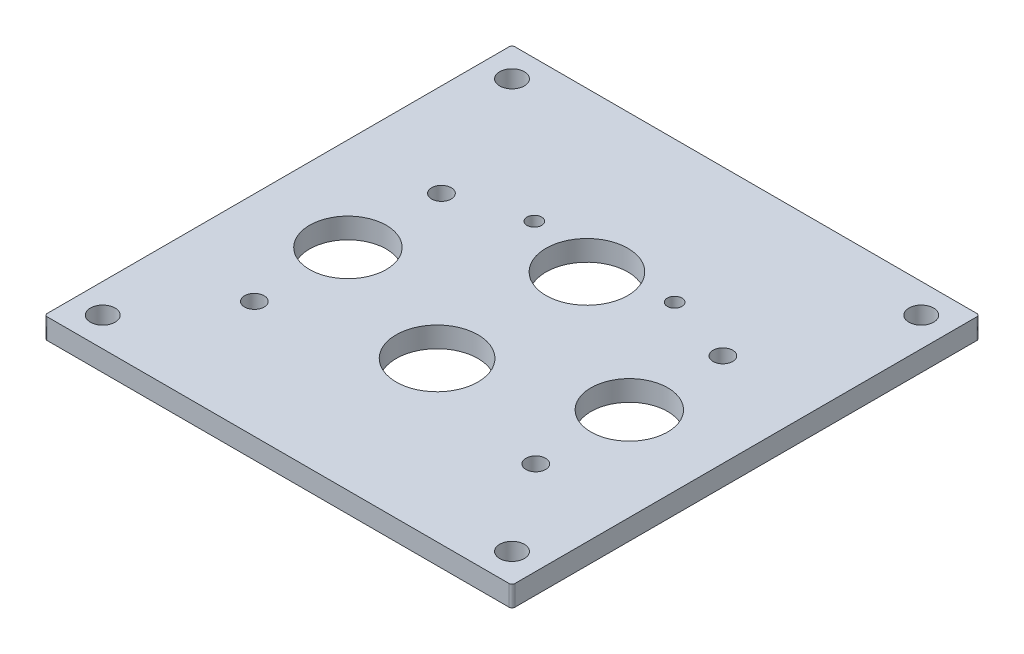
ISO-10303-21;
HEADER;
FILE_DESCRIPTION(('STEP AP214'),'2;1');
FILE_NAME('part.step','',(''),(''),'','','');
FILE_SCHEMA(('AUTOMOTIVE_DESIGN { 1 0 10303 214 1 1 1 1 }'));
ENDSEC;
DATA;
#1=APPLICATION_CONTEXT('core data for automotive mechanical design processes');
#2=APPLICATION_PROTOCOL_DEFINITION('international standard','automotive_design',2000,#1);
#3=PRODUCT_CONTEXT('',#1,'mechanical');
#4=PRODUCT('Part','Part','',(#3));
#5=PRODUCT_RELATED_PRODUCT_CATEGORY('part','',(#4));
#6=PRODUCT_DEFINITION_FORMATION('','',#4);
#7=PRODUCT_DEFINITION_CONTEXT('part definition',#1,'design');
#8=PRODUCT_DEFINITION('design','',#6,#7);
#9=PRODUCT_DEFINITION_SHAPE('','',#8);
#10=(LENGTH_UNIT() NAMED_UNIT(*) SI_UNIT(.MILLI.,.METRE.));
#11=(NAMED_UNIT(*) PLANE_ANGLE_UNIT() SI_UNIT($,.RADIAN.));
#12=(NAMED_UNIT(*) SI_UNIT($,.STERADIAN.) SOLID_ANGLE_UNIT());
#13=UNCERTAINTY_MEASURE_WITH_UNIT(LENGTH_MEASURE(1.E-05),#10,'distance_accuracy_value','');
#14=(GEOMETRIC_REPRESENTATION_CONTEXT(3) GLOBAL_UNCERTAINTY_ASSIGNED_CONTEXT((#13)) GLOBAL_UNIT_ASSIGNED_CONTEXT((#10,
#11,#12)) REPRESENTATION_CONTEXT('',''));
#15=CARTESIAN_POINT('',(0.,0.,0.));
#16=DIRECTION('',(0.,0.,1.));
#17=DIRECTION('',(1.,0.,0.));
#18=AXIS2_PLACEMENT_3D('',#15,#16,#17);
#19=CARTESIAN_POINT('',(76.3793482316,0.,47.8960233086));
#20=DIRECTION('',(0.,-1.,0.));
#21=DIRECTION('',(0.,0.,-1.));
#22=AXIS2_PLACEMENT_3D('',#19,#20,#21);
#23=CYLINDRICAL_SURFACE('',#22,0.79375000000001);
#24=DIRECTION('',(0.,1.,0.));
#25=VECTOR('',#24,1.);
#26=CARTESIAN_POINT('',(77.1730982344487,0.,47.8960233086));
#27=LINE('',#26,#25);
#28=CARTESIAN_POINT('',(77.1730982330243,-5.588,47.8960233086));
#29=VERTEX_POINT('',#28);
#30=CARTESIAN_POINT('',(77.1730982330243,0.,47.8960233086));
#31=VERTEX_POINT('',#30);
#32=EDGE_CURVE('E101',#29,#31,#27,.T.);
#33=ORIENTED_EDGE('',*,*,#32,.T.);
#34=CARTESIAN_POINT('',(76.3793482316,0.,47.8960233086));
#35=DIRECTION('',(0.,-1.,0.));
#36=DIRECTION('',(0.,0.,-1.));
#37=AXIS2_PLACEMENT_3D('',#34,#35,#36);
#38=CIRCLE('',#37,0.79375000000001);
#39=CARTESIAN_POINT('',(76.3793482316,0.,48.6897733032364));
#40=VERTEX_POINT('',#39);
#41=EDGE_CURVE('E20',#40,#31,#38,.F.);
#42=ORIENTED_EDGE('',*,*,#41,.F.);
#43=DIRECTION('',(0.,1.,0.));
#44=VECTOR('',#43,1.);
#45=CARTESIAN_POINT('',(76.3793482316,0.,48.6897732978727));
#46=LINE('',#45,#44);
#47=CARTESIAN_POINT('',(76.3793482316,-5.588,48.6897733032364));
#48=VERTEX_POINT('',#47);
#49=EDGE_CURVE('E112',#40,#48,#46,.F.);
#50=ORIENTED_EDGE('',*,*,#49,.T.);
#51=CARTESIAN_POINT('',(76.3793482316,-5.588,47.8960233086));
#52=DIRECTION('',(0.,-1.,0.));
#53=DIRECTION('',(0.,0.,-1.));
#54=AXIS2_PLACEMENT_3D('',#51,#52,#53);
#55=CIRCLE('',#54,0.79375000000001);
#56=EDGE_CURVE('E225',#29,#48,#55,.T.);
#57=ORIENTED_EDGE('',*,*,#56,.F.);
#58=EDGE_LOOP('',(#33,#42,#50,#57));
#59=FACE_BOUND('',#58,.T.);
#60=ADVANCED_FACE('F17',(#59),#23,.T.);
#61=CARTESIAN_POINT('',(-49.0331517684,0.,47.8960233086));
#62=DIRECTION('',(0.,-1.,0.));
#63=DIRECTION('',(0.,0.,-1.));
#64=AXIS2_PLACEMENT_3D('',#61,#62,#63);
#65=CYLINDRICAL_SURFACE('',#64,0.793749999999996);
#66=DIRECTION('',(0.,1.,0.));
#67=VECTOR('',#66,1.);
#68=CARTESIAN_POINT('',(-49.0331517684,0.,48.6897732978727));
#69=LINE('',#68,#67);
#70=CARTESIAN_POINT('',(-49.0331517684,-5.588,48.6897733032364));
#71=VERTEX_POINT('',#70);
#72=CARTESIAN_POINT('',(-49.0331517684,0.,48.6897733032364));
#73=VERTEX_POINT('',#72);
#74=EDGE_CURVE('E132',#71,#73,#69,.T.);
#75=ORIENTED_EDGE('',*,*,#74,.T.);
#76=CARTESIAN_POINT('',(-49.0331517684,0.,47.8960233086));
#77=DIRECTION('',(0.,-1.,0.));
#78=DIRECTION('',(0.,0.,-1.));
#79=AXIS2_PLACEMENT_3D('',#76,#77,#78);
#80=CIRCLE('',#79,0.793749999999996);
#81=CARTESIAN_POINT('',(-49.8269017669757,0.,47.8960233086));
#82=VERTEX_POINT('',#81);
#83=EDGE_CURVE('E224',#82,#73,#80,.F.);
#84=ORIENTED_EDGE('',*,*,#83,.F.);
#85=DIRECTION('',(0.,1.,0.));
#86=VECTOR('',#85,1.);
#87=CARTESIAN_POINT('',(-49.8269017655513,0.,47.8960233086));
#88=LINE('',#87,#86);
#89=CARTESIAN_POINT('',(-49.8269017669757,-5.588,47.8960233086));
#90=VERTEX_POINT('',#89);
#91=EDGE_CURVE('E111',#82,#90,#88,.F.);
#92=ORIENTED_EDGE('',*,*,#91,.T.);
#93=CARTESIAN_POINT('',(-49.0331517684,-5.588,47.8960233086));
#94=DIRECTION('',(0.,-1.,0.));
#95=DIRECTION('',(0.,0.,-1.));
#96=AXIS2_PLACEMENT_3D('',#93,#94,#95);
#97=CIRCLE('',#96,0.793749999999996);
#98=EDGE_CURVE('E116',#71,#90,#97,.T.);
#99=ORIENTED_EDGE('',*,*,#98,.F.);
#100=EDGE_LOOP('',(#75,#84,#92,#99));
#101=FACE_BOUND('',#100,.T.);
#102=ADVANCED_FACE('F234',(#101),#65,.T.);
#103=CARTESIAN_POINT('',(76.3793482316,0.,-77.5164766914));
#104=DIRECTION('',(0.,-1.,0.));
#105=DIRECTION('',(0.,0.,-1.));
#106=AXIS2_PLACEMENT_3D('',#103,#104,#105);
#107=CYLINDRICAL_SURFACE('',#106,0.79375000000001);
#108=DIRECTION('',(0.,1.,0.));
#109=VECTOR('',#108,1.);
#110=CARTESIAN_POINT('',(76.3793482316,0.,-78.3102266698692));
#111=LINE('',#110,#109);
#112=CARTESIAN_POINT('',(76.3793482316,-5.588,-78.3102266806346));
#113=VERTEX_POINT('',#112);
#114=CARTESIAN_POINT('',(76.3793482316,0.,-78.3102266806346));
#115=VERTEX_POINT('',#114);
#116=EDGE_CURVE('E128',#113,#115,#111,.T.);
#117=ORIENTED_EDGE('',*,*,#116,.T.);
#118=CARTESIAN_POINT('',(76.3793482316,0.,-77.5164766914));
#119=DIRECTION('',(0.,-1.,0.));
#120=DIRECTION('',(0.,0.,-1.));
#121=AXIS2_PLACEMENT_3D('',#118,#119,#120);
#122=CIRCLE('',#121,0.79375000000001);
#123=CARTESIAN_POINT('',(77.1730982330243,0.,-77.5164766914));
#124=VERTEX_POINT('',#123);
#125=EDGE_CURVE('E35',#124,#115,#122,.F.);
#126=ORIENTED_EDGE('',*,*,#125,.F.);
#127=DIRECTION('',(0.,1.,0.));
#128=VECTOR('',#127,1.);
#129=CARTESIAN_POINT('',(77.1730982344487,0.,-77.5164766914));
#130=LINE('',#129,#128);
#131=CARTESIAN_POINT('',(77.1730982330243,-5.588,-77.5164766914));
#132=VERTEX_POINT('',#131);
#133=EDGE_CURVE('E135',#124,#132,#130,.F.);
#134=ORIENTED_EDGE('',*,*,#133,.T.);
#135=CARTESIAN_POINT('',(76.3793482316,-5.588,-77.5164766914));
#136=DIRECTION('',(0.,-1.,0.));
#137=DIRECTION('',(0.,0.,-1.));
#138=AXIS2_PLACEMENT_3D('',#135,#136,#137);
#139=CIRCLE('',#138,0.79375000000001);
#140=EDGE_CURVE('E79',#113,#132,#139,.T.);
#141=ORIENTED_EDGE('',*,*,#140,.F.);
#142=EDGE_LOOP('',(#117,#126,#134,#141));
#143=FACE_BOUND('',#142,.T.);
#144=ADVANCED_FACE('F244',(#143),#107,.T.);
#145=CARTESIAN_POINT('',(-49.0331517684,0.,-77.5164766914));
#146=DIRECTION('',(0.,-1.,0.));
#147=DIRECTION('',(0.,0.,-1.));
#148=AXIS2_PLACEMENT_3D('',#145,#146,#147);
#149=CYLINDRICAL_SURFACE('',#148,0.793750000000003);
#150=DIRECTION('',(0.,1.,0.));
#151=VECTOR('',#150,1.);
#152=CARTESIAN_POINT('',(-49.8269017655513,0.,-77.5164766914));
#153=LINE('',#152,#151);
#154=CARTESIAN_POINT('',(-49.8269017669757,-5.588,-77.5164766914));
#155=VERTEX_POINT('',#154);
#156=CARTESIAN_POINT('',(-49.8269017669757,0.,-77.5164766914));
#157=VERTEX_POINT('',#156);
#158=EDGE_CURVE('E95',#155,#157,#153,.T.);
#159=ORIENTED_EDGE('',*,*,#158,.T.);
#160=CARTESIAN_POINT('',(-49.0331517684,0.,-77.5164766914));
#161=DIRECTION('',(0.,-1.,0.));
#162=DIRECTION('',(0.,0.,-1.));
#163=AXIS2_PLACEMENT_3D('',#160,#161,#162);
#164=CIRCLE('',#163,0.793750000000003);
#165=CARTESIAN_POINT('',(-49.0331517684,0.,-78.3102266806346));
#166=VERTEX_POINT('',#165);
#167=EDGE_CURVE('E102',#166,#157,#164,.F.);
#168=ORIENTED_EDGE('',*,*,#167,.F.);
#169=DIRECTION('',(0.,1.,0.));
#170=VECTOR('',#169,1.);
#171=CARTESIAN_POINT('',(-49.0331517684,0.,-78.3102266698692));
#172=LINE('',#171,#170);
#173=CARTESIAN_POINT('',(-49.0331517684,-5.588,-78.3102266806346));
#174=VERTEX_POINT('',#173);
#175=EDGE_CURVE('E98',#166,#174,#172,.F.);
#176=ORIENTED_EDGE('',*,*,#175,.T.);
#177=CARTESIAN_POINT('',(-49.0331517684,-5.588,-77.5164766914));
#178=DIRECTION('',(0.,-1.,0.));
#179=DIRECTION('',(0.,0.,-1.));
#180=AXIS2_PLACEMENT_3D('',#177,#178,#179);
#181=CIRCLE('',#180,0.793750000000003);
#182=EDGE_CURVE('E92',#155,#174,#181,.T.);
#183=ORIENTED_EDGE('',*,*,#182,.F.);
#184=EDGE_LOOP('',(#159,#168,#176,#183));
#185=FACE_BOUND('',#184,.T.);
#186=ADVANCED_FACE('F94',(#185),#149,.T.);
#187=CARTESIAN_POINT('',(77.1730982344487,0.,0.));
#188=DIRECTION('',(1.,0.,0.));
#189=DIRECTION('',(0.,0.,-1.));
#190=AXIS2_PLACEMENT_3D('',#187,#188,#189);
#191=PLANE('',#190);
#192=ORIENTED_EDGE('',*,*,#133,.F.);
#193=DIRECTION('',(0.,0.,-1.));
#194=VECTOR('',#193,1.);
#195=CARTESIAN_POINT('',(77.1730982316,0.,0.));
#196=LINE('',#195,#194);
#197=EDGE_CURVE('E183',#124,#31,#196,.F.);
#198=ORIENTED_EDGE('',*,*,#197,.T.);
#199=ORIENTED_EDGE('',*,*,#32,.F.);
#200=DIRECTION('',(0.,0.,-1.));
#201=VECTOR('',#200,1.);
#202=CARTESIAN_POINT('',(77.1730982316,-5.58800000012903,0.));
#203=LINE('',#202,#201);
#204=EDGE_CURVE('E122',#29,#132,#203,.T.);
#205=ORIENTED_EDGE('',*,*,#204,.T.);
#206=EDGE_LOOP('',(#192,#198,#199,#205));
#207=FACE_BOUND('',#206,.T.);
#208=ADVANCED_FACE('F243',(#207),#191,.T.);
#209=CARTESIAN_POINT('',(0.,0.,48.6897732978727));
#210=DIRECTION('',(0.,0.,1.));
#211=DIRECTION('',(1.,0.,0.));
#212=AXIS2_PLACEMENT_3D('',#209,#210,#211);
#213=PLANE('',#212);
#214=ORIENTED_EDGE('',*,*,#49,.F.);
#215=DIRECTION('',(1.,0.,0.));
#216=VECTOR('',#215,1.);
#217=CARTESIAN_POINT('',(0.,0.,48.6897733086));
#218=LINE('',#217,#216);
#219=EDGE_CURVE('E232',#40,#73,#218,.F.);
#220=ORIENTED_EDGE('',*,*,#219,.T.);
#221=ORIENTED_EDGE('',*,*,#74,.F.);
#222=DIRECTION('',(1.,0.,0.));
#223=VECTOR('',#222,1.);
#224=CARTESIAN_POINT('',(0.,-5.58800000012903,48.6897733086));
#225=LINE('',#224,#223);
#226=EDGE_CURVE('E118',#71,#48,#225,.T.);
#227=ORIENTED_EDGE('',*,*,#226,.T.);
#228=EDGE_LOOP('',(#214,#220,#221,#227));
#229=FACE_BOUND('',#228,.T.);
#230=ADVANCED_FACE('F231',(#229),#213,.T.);
#231=CARTESIAN_POINT('',(-49.8269017655513,0.,0.));
#232=DIRECTION('',(-1.,0.,0.));
#233=DIRECTION('',(0.,0.,1.));
#234=AXIS2_PLACEMENT_3D('',#231,#232,#233);
#235=PLANE('',#234);
#236=ORIENTED_EDGE('',*,*,#91,.F.);
#237=DIRECTION('',(0.,0.,-1.));
#238=VECTOR('',#237,1.);
#239=CARTESIAN_POINT('',(-49.8269017684,0.,0.));
#240=LINE('',#239,#238);
#241=EDGE_CURVE('E110',#82,#157,#240,.T.);
#242=ORIENTED_EDGE('',*,*,#241,.T.);
#243=ORIENTED_EDGE('',*,*,#158,.F.);
#244=DIRECTION('',(0.,0.,-1.));
#245=VECTOR('',#244,1.);
#246=CARTESIAN_POINT('',(-49.8269017684,-5.58800000012903,0.));
#247=LINE('',#246,#245);
#248=EDGE_CURVE('E108',#155,#90,#247,.F.);
#249=ORIENTED_EDGE('',*,*,#248,.T.);
#250=EDGE_LOOP('',(#236,#242,#243,#249));
#251=FACE_BOUND('',#250,.T.);
#252=ADVANCED_FACE('F107',(#251),#235,.T.);
#253=CARTESIAN_POINT('',(0.,0.,-78.3102266698692));
#254=DIRECTION('',(0.,0.,-1.));
#255=DIRECTION('',(-1.,0.,0.));
#256=AXIS2_PLACEMENT_3D('',#253,#254,#255);
#257=PLANE('',#256);
#258=ORIENTED_EDGE('',*,*,#175,.F.);
#259=DIRECTION('',(1.,0.,0.));
#260=VECTOR('',#259,1.);
#261=CARTESIAN_POINT('',(0.,0.,-78.3102266914));
#262=LINE('',#261,#260);
#263=EDGE_CURVE('E179',#166,#115,#262,.T.);
#264=ORIENTED_EDGE('',*,*,#263,.T.);
#265=ORIENTED_EDGE('',*,*,#116,.F.);
#266=DIRECTION('',(1.,0.,0.));
#267=VECTOR('',#266,1.);
#268=CARTESIAN_POINT('',(0.,-5.58800000012903,-78.3102266914));
#269=LINE('',#268,#267);
#270=EDGE_CURVE('E119',#113,#174,#269,.F.);
#271=ORIENTED_EDGE('',*,*,#270,.T.);
#272=EDGE_LOOP('',(#258,#264,#265,#271));
#273=FACE_BOUND('',#272,.T.);
#274=ADVANCED_FACE('F247',(#273),#257,.T.);
#275=CARTESIAN_POINT('',(-24.53514673098,0.,-33.8602266914));
#276=DIRECTION('',(0.,-1.,0.));
#277=DIRECTION('',(0.,0.,-1.));
#278=AXIS2_PLACEMENT_3D('',#275,#276,#277);
#279=CYLINDRICAL_SURFACE('',#278,2.667);
#280=CARTESIAN_POINT('',(-24.53514673098,0.,-33.8602266914));
#281=DIRECTION('',(0.,-1.,0.));
#282=DIRECTION('',(0.,0.,-1.));
#283=AXIS2_PLACEMENT_3D('',#280,#281,#282);
#284=CIRCLE('',#283,2.667);
#285=CARTESIAN_POINT('',(-24.53514673098,0.,-36.5272266914));
#286=VERTEX_POINT('',#285);
#287=EDGE_CURVE('E176',#286,#286,#284,.F.);
#288=ORIENTED_EDGE('',*,*,#287,.T.);
#289=EDGE_LOOP('',(#288));
#290=FACE_BOUND('',#289,.T.);
#291=CARTESIAN_POINT('',(-24.53514673098,-5.588,-33.8602266914));
#292=DIRECTION('',(0.,-1.,0.));
#293=DIRECTION('',(0.,0.,-1.));
#294=AXIS2_PLACEMENT_3D('',#291,#292,#293);
#295=CIRCLE('',#294,2.667);
#296=CARTESIAN_POINT('',(-24.53514673098,-5.588,-36.5272266914));
#297=VERTEX_POINT('',#296);
#298=EDGE_CURVE('E217',#297,#297,#295,.T.);
#299=ORIENTED_EDGE('',*,*,#298,.T.);
#300=EDGE_LOOP('',(#299));
#301=FACE_BOUND('',#300,.T.);
#302=ADVANCED_FACE('F249',(#290,#301),#279,.F.);
#303=CARTESIAN_POINT('',(-24.53514673098,0.,16.93977329844));
#304=DIRECTION('',(0.,-1.,0.));
#305=DIRECTION('',(0.,0.,-1.));
#306=AXIS2_PLACEMENT_3D('',#303,#304,#305);
#307=CYLINDRICAL_SURFACE('',#306,2.667);
#308=CARTESIAN_POINT('',(-24.53514673098,0.,16.93977329844));
#309=DIRECTION('',(0.,-1.,0.));
#310=DIRECTION('',(0.,0.,-1.));
#311=AXIS2_PLACEMENT_3D('',#308,#309,#310);
#312=CIRCLE('',#311,2.667);
#313=CARTESIAN_POINT('',(-24.53514673098,0.,14.27277329844));
#314=VERTEX_POINT('',#313);
#315=EDGE_CURVE('E173',#314,#314,#312,.F.);
#316=ORIENTED_EDGE('',*,*,#315,.T.);
#317=EDGE_LOOP('',(#316));
#318=FACE_BOUND('',#317,.T.);
#319=CARTESIAN_POINT('',(-24.53514673098,-5.588,16.93977329844));
#320=DIRECTION('',(0.,-1.,0.));
#321=DIRECTION('',(0.,0.,-1.));
#322=AXIS2_PLACEMENT_3D('',#319,#320,#321);
#323=CIRCLE('',#322,2.667);
#324=CARTESIAN_POINT('',(-24.53514673098,-5.588,14.27277329844));
#325=VERTEX_POINT('',#324);
#326=EDGE_CURVE('E214',#325,#325,#323,.T.);
#327=ORIENTED_EDGE('',*,*,#326,.T.);
#328=EDGE_LOOP('',(#327));
#329=FACE_BOUND('',#328,.T.);
#330=ADVANCED_FACE('F256',(#318,#329),#307,.F.);
#331=CARTESIAN_POINT('',(-24.53514673098,0.,-8.46022669902001));
#332=DIRECTION('',(0.,-1.,0.));
#333=DIRECTION('',(0.,0.,-1.));
#334=AXIS2_PLACEMENT_3D('',#331,#332,#333);
#335=CYLINDRICAL_SURFACE('',#334,10.414);
#336=CARTESIAN_POINT('',(-24.53514673098,0.,-8.46022669902001));
#337=DIRECTION('',(0.,-1.,0.));
#338=DIRECTION('',(0.,0.,-1.));
#339=AXIS2_PLACEMENT_3D('',#336,#337,#338);
#340=CIRCLE('',#339,10.414);
#341=CARTESIAN_POINT('',(-24.53514673098,0.,-18.87422669902));
#342=VERTEX_POINT('',#341);
#343=EDGE_CURVE('E170',#342,#342,#340,.F.);
#344=ORIENTED_EDGE('',*,*,#343,.T.);
#345=EDGE_LOOP('',(#344));
#346=FACE_BOUND('',#345,.T.);
#347=CARTESIAN_POINT('',(-24.53514673098,-5.588,-8.46022669902001));
#348=DIRECTION('',(0.,-1.,0.));
#349=DIRECTION('',(0.,0.,-1.));
#350=AXIS2_PLACEMENT_3D('',#347,#348,#349);
#351=CIRCLE('',#350,10.414);
#352=CARTESIAN_POINT('',(-24.53514673098,-5.588,-18.87422669902));
#353=VERTEX_POINT('',#352);
#354=EDGE_CURVE('E211',#353,#353,#351,.T.);
#355=ORIENTED_EDGE('',*,*,#354,.T.);
#356=EDGE_LOOP('',(#355));
#357=FACE_BOUND('',#356,.T.);
#358=ADVANCED_FACE('F314',(#346,#357),#335,.F.);
#359=CARTESIAN_POINT('',(51.8813432018,0.,16.93977329844));
#360=DIRECTION('',(0.,-1.,0.));
#361=DIRECTION('',(0.,0.,-1.));
#362=AXIS2_PLACEMENT_3D('',#359,#360,#361);
#363=CYLINDRICAL_SURFACE('',#362,2.667);
#364=CARTESIAN_POINT('',(51.8813432018,0.,16.93977329844));
#365=DIRECTION('',(0.,-1.,0.));
#366=DIRECTION('',(0.,0.,-1.));
#367=AXIS2_PLACEMENT_3D('',#364,#365,#366);
#368=CIRCLE('',#367,2.667);
#369=CARTESIAN_POINT('',(51.8813432018,0.,14.27277329844));
#370=VERTEX_POINT('',#369);
#371=EDGE_CURVE('E167',#370,#370,#368,.F.);
#372=ORIENTED_EDGE('',*,*,#371,.T.);
#373=EDGE_LOOP('',(#372));
#374=FACE_BOUND('',#373,.T.);
#375=CARTESIAN_POINT('',(51.8813432018,-5.588,16.93977329844));
#376=DIRECTION('',(0.,-1.,0.));
#377=DIRECTION('',(0.,0.,-1.));
#378=AXIS2_PLACEMENT_3D('',#375,#376,#377);
#379=CIRCLE('',#378,2.667);
#380=CARTESIAN_POINT('',(51.8813432018,-5.588,14.27277329844));
#381=VERTEX_POINT('',#380);
#382=EDGE_CURVE('E208',#381,#381,#379,.T.);
#383=ORIENTED_EDGE('',*,*,#382,.T.);
#384=EDGE_LOOP('',(#383));
#385=FACE_BOUND('',#384,.T.);
#386=ADVANCED_FACE('F310',(#374,#385),#363,.F.);
#387=CARTESIAN_POINT('',(13.67309823668,0.,-35.1556266914));
#388=DIRECTION('',(0.,-1.,0.));
#389=DIRECTION('',(0.,0.,-1.));
#390=AXIS2_PLACEMENT_3D('',#387,#388,#389);
#391=CYLINDRICAL_SURFACE('',#390,11.1125);
#392=CARTESIAN_POINT('',(13.67309823668,0.,-35.1556266914));
#393=DIRECTION('',(0.,-1.,0.));
#394=DIRECTION('',(0.,0.,-1.));
#395=AXIS2_PLACEMENT_3D('',#392,#393,#394);
#396=CIRCLE('',#395,11.1125);
#397=CARTESIAN_POINT('',(13.67309823668,0.,-46.2681266914));
#398=VERTEX_POINT('',#397);
#399=EDGE_CURVE('E164',#398,#398,#396,.F.);
#400=ORIENTED_EDGE('',*,*,#399,.T.);
#401=EDGE_LOOP('',(#400));
#402=FACE_BOUND('',#401,.T.);
#403=CARTESIAN_POINT('',(13.67309823668,-5.588,-35.1556266914));
#404=DIRECTION('',(0.,-1.,0.));
#405=DIRECTION('',(0.,0.,-1.));
#406=AXIS2_PLACEMENT_3D('',#403,#404,#405);
#407=CIRCLE('',#406,11.1125);
#408=CARTESIAN_POINT('',(13.67309823668,-5.588,-46.2681266914));
#409=VERTEX_POINT('',#408);
#410=EDGE_CURVE('E205',#409,#409,#407,.T.);
#411=ORIENTED_EDGE('',*,*,#410,.T.);
#412=EDGE_LOOP('',(#411));
#413=FACE_BOUND('',#412,.T.);
#414=ADVANCED_FACE('F306',(#402,#413),#391,.F.);
#415=CARTESIAN_POINT('',(-41.8894017684,0.,-70.3727266914));
#416=DIRECTION('',(0.,-1.,0.));
#417=DIRECTION('',(0.,0.,-1.));
#418=AXIS2_PLACEMENT_3D('',#415,#416,#417);
#419=CYLINDRICAL_SURFACE('',#418,3.35279999999999);
#420=CARTESIAN_POINT('',(-41.8894017684,0.,-70.3727266914));
#421=DIRECTION('',(0.,-1.,0.));
#422=DIRECTION('',(0.,0.,-1.));
#423=AXIS2_PLACEMENT_3D('',#420,#421,#422);
#424=CIRCLE('',#423,3.35279999999999);
#425=CARTESIAN_POINT('',(-41.8894017684,0.,-73.7255266914));
#426=VERTEX_POINT('',#425);
#427=EDGE_CURVE('E161',#426,#426,#424,.F.);
#428=ORIENTED_EDGE('',*,*,#427,.T.);
#429=EDGE_LOOP('',(#428));
#430=FACE_BOUND('',#429,.T.);
#431=CARTESIAN_POINT('',(-41.8894017684,-5.588,-70.3727266914));
#432=DIRECTION('',(0.,-1.,0.));
#433=DIRECTION('',(0.,0.,-1.));
#434=AXIS2_PLACEMENT_3D('',#431,#432,#433);
#435=CIRCLE('',#434,3.35279999999999);
#436=CARTESIAN_POINT('',(-41.8894017684,-5.588,-73.7255266914));
#437=VERTEX_POINT('',#436);
#438=EDGE_CURVE('E202',#437,#437,#435,.T.);
#439=ORIENTED_EDGE('',*,*,#438,.T.);
#440=EDGE_LOOP('',(#439));
#441=FACE_BOUND('',#440,.T.);
#442=ADVANCED_FACE('F302',(#430,#441),#419,.F.);
#443=CARTESIAN_POINT('',(69.2355982316,0.,40.7522733086));
#444=DIRECTION('',(0.,-1.,0.));
#445=DIRECTION('',(0.,0.,-1.));
#446=AXIS2_PLACEMENT_3D('',#443,#444,#445);
#447=CYLINDRICAL_SURFACE('',#446,3.3528);
#448=CARTESIAN_POINT('',(69.2355982316,0.,40.7522733086));
#449=DIRECTION('',(0.,-1.,0.));
#450=DIRECTION('',(0.,0.,-1.));
#451=AXIS2_PLACEMENT_3D('',#448,#449,#450);
#452=CIRCLE('',#451,3.3528);
#453=CARTESIAN_POINT('',(69.2355982316,0.,37.3994733086));
#454=VERTEX_POINT('',#453);
#455=EDGE_CURVE('E158',#454,#454,#452,.F.);
#456=ORIENTED_EDGE('',*,*,#455,.T.);
#457=EDGE_LOOP('',(#456));
#458=FACE_BOUND('',#457,.T.);
#459=CARTESIAN_POINT('',(69.2355982316,-5.588,40.7522733086));
#460=DIRECTION('',(0.,-1.,0.));
#461=DIRECTION('',(0.,0.,-1.));
#462=AXIS2_PLACEMENT_3D('',#459,#460,#461);
#463=CIRCLE('',#462,3.3528);
#464=CARTESIAN_POINT('',(69.2355982316,-5.588,37.3994733086));
#465=VERTEX_POINT('',#464);
#466=EDGE_CURVE('E199',#465,#465,#463,.T.);
#467=ORIENTED_EDGE('',*,*,#466,.T.);
#468=EDGE_LOOP('',(#467));
#469=FACE_BOUND('',#468,.T.);
#470=ADVANCED_FACE('F298',(#458,#469),#447,.F.);
#471=CARTESIAN_POINT('',(69.2355982316,0.,-70.3727266914));
#472=DIRECTION('',(0.,-1.,0.));
#473=DIRECTION('',(0.,0.,-1.));
#474=AXIS2_PLACEMENT_3D('',#471,#472,#473);
#475=CYLINDRICAL_SURFACE('',#474,3.35279999999999);
#476=CARTESIAN_POINT('',(69.2355982316,0.,-70.3727266914));
#477=DIRECTION('',(0.,-1.,0.));
#478=DIRECTION('',(0.,0.,-1.));
#479=AXIS2_PLACEMENT_3D('',#476,#477,#478);
#480=CIRCLE('',#479,3.35279999999999);
#481=CARTESIAN_POINT('',(69.2355982316,0.,-73.7255266914));
#482=VERTEX_POINT('',#481);
#483=EDGE_CURVE('E155',#482,#482,#480,.F.);
#484=ORIENTED_EDGE('',*,*,#483,.T.);
#485=EDGE_LOOP('',(#484));
#486=FACE_BOUND('',#485,.T.);
#487=CARTESIAN_POINT('',(69.2355982316,-5.588,-70.3727266914));
#488=DIRECTION('',(0.,-1.,0.));
#489=DIRECTION('',(0.,0.,-1.));
#490=AXIS2_PLACEMENT_3D('',#487,#488,#489);
#491=CIRCLE('',#490,3.35279999999999);
#492=CARTESIAN_POINT('',(69.2355982316,-5.588,-73.7255266914));
#493=VERTEX_POINT('',#492);
#494=EDGE_CURVE('E196',#493,#493,#491,.T.);
#495=ORIENTED_EDGE('',*,*,#494,.T.);
#496=EDGE_LOOP('',(#495));
#497=FACE_BOUND('',#496,.T.);
#498=ADVANCED_FACE('F294',(#486,#497),#475,.F.);
#499=CARTESIAN_POINT('',(13.67309823668,0.,5.53517330098));
#500=DIRECTION('',(0.,-1.,0.));
#501=DIRECTION('',(0.,0.,-1.));
#502=AXIS2_PLACEMENT_3D('',#499,#500,#501);
#503=CYLINDRICAL_SURFACE('',#502,11.1125);
#504=CARTESIAN_POINT('',(13.67309823668,0.,5.53517330098));
#505=DIRECTION('',(0.,-1.,0.));
#506=DIRECTION('',(0.,0.,-1.));
#507=AXIS2_PLACEMENT_3D('',#504,#505,#506);
#508=CIRCLE('',#507,11.1125);
#509=CARTESIAN_POINT('',(13.67309823668,0.,-5.57732669902));
#510=VERTEX_POINT('',#509);
#511=EDGE_CURVE('E152',#510,#510,#508,.F.);
#512=ORIENTED_EDGE('',*,*,#511,.T.);
#513=EDGE_LOOP('',(#512));
#514=FACE_BOUND('',#513,.T.);
#515=CARTESIAN_POINT('',(13.67309823668,-5.588,5.53517330098));
#516=DIRECTION('',(0.,-1.,0.));
#517=DIRECTION('',(0.,0.,-1.));
#518=AXIS2_PLACEMENT_3D('',#515,#516,#517);
#519=CIRCLE('',#518,11.1125);
#520=CARTESIAN_POINT('',(13.67309823668,-5.588,-5.57732669902));
#521=VERTEX_POINT('',#520);
#522=EDGE_CURVE('E193',#521,#521,#519,.T.);
#523=ORIENTED_EDGE('',*,*,#522,.T.);
#524=EDGE_LOOP('',(#523));
#525=FACE_BOUND('',#524,.T.);
#526=ADVANCED_FACE('F290',(#514,#525),#503,.F.);
#527=CARTESIAN_POINT('',(-41.8894017684,0.,40.7522733086));
#528=DIRECTION('',(0.,-1.,0.));
#529=DIRECTION('',(0.,0.,-1.));
#530=AXIS2_PLACEMENT_3D('',#527,#528,#529);
#531=CYLINDRICAL_SURFACE('',#530,3.3528);
#532=CARTESIAN_POINT('',(-41.8894017684,0.,40.7522733086));
#533=DIRECTION('',(0.,-1.,0.));
#534=DIRECTION('',(0.,0.,-1.));
#535=AXIS2_PLACEMENT_3D('',#532,#533,#534);
#536=CIRCLE('',#535,3.3528);
#537=CARTESIAN_POINT('',(-41.8894017684,0.,37.3994733086));
#538=VERTEX_POINT('',#537);
#539=EDGE_CURVE('E149',#538,#538,#536,.F.);
#540=ORIENTED_EDGE('',*,*,#539,.T.);
#541=EDGE_LOOP('',(#540));
#542=FACE_BOUND('',#541,.T.);
#543=CARTESIAN_POINT('',(-41.8894017684,-5.588,40.7522733086));
#544=DIRECTION('',(0.,-1.,0.));
#545=DIRECTION('',(0.,0.,-1.));
#546=AXIS2_PLACEMENT_3D('',#543,#544,#545);
#547=CIRCLE('',#546,3.3528);
#548=CARTESIAN_POINT('',(-41.8894017684,-5.588,37.3994733086));
#549=VERTEX_POINT('',#548);
#550=EDGE_CURVE('E190',#549,#549,#547,.T.);
#551=ORIENTED_EDGE('',*,*,#550,.T.);
#552=EDGE_LOOP('',(#551));
#553=FACE_BOUND('',#552,.T.);
#554=ADVANCED_FACE('F286',(#542,#553),#531,.F.);
#555=CARTESIAN_POINT('',(51.8813432018,0.,-33.8602266914));
#556=DIRECTION('',(0.,-1.,0.));
#557=DIRECTION('',(0.,0.,-1.));
#558=AXIS2_PLACEMENT_3D('',#555,#556,#557);
#559=CYLINDRICAL_SURFACE('',#558,2.667);
#560=CARTESIAN_POINT('',(51.8813432018,0.,-33.8602266914));
#561=DIRECTION('',(0.,-1.,0.));
#562=DIRECTION('',(0.,0.,-1.));
#563=AXIS2_PLACEMENT_3D('',#560,#561,#562);
#564=CIRCLE('',#563,2.667);
#565=CARTESIAN_POINT('',(51.8813432018,0.,-36.5272266914));
#566=VERTEX_POINT('',#565);
#567=EDGE_CURVE('E146',#566,#566,#564,.F.);
#568=ORIENTED_EDGE('',*,*,#567,.T.);
#569=EDGE_LOOP('',(#568));
#570=FACE_BOUND('',#569,.T.);
#571=CARTESIAN_POINT('',(51.8813432018,-5.588,-33.8602266914));
#572=DIRECTION('',(0.,-1.,0.));
#573=DIRECTION('',(0.,0.,-1.));
#574=AXIS2_PLACEMENT_3D('',#571,#572,#573);
#575=CIRCLE('',#574,2.667);
#576=CARTESIAN_POINT('',(51.8813432018,-5.588,-36.5272266914));
#577=VERTEX_POINT('',#576);
#578=EDGE_CURVE('E187',#577,#577,#575,.T.);
#579=ORIENTED_EDGE('',*,*,#578,.T.);
#580=EDGE_LOOP('',(#579));
#581=FACE_BOUND('',#580,.T.);
#582=ADVANCED_FACE('F282',(#570,#581),#559,.F.);
#583=CARTESIAN_POINT('',(32.7230982316,0.,-39.9181266914));
#584=DIRECTION('',(0.,-1.,0.));
#585=DIRECTION('',(0.,0.,-1.));
#586=AXIS2_PLACEMENT_3D('',#583,#584,#585);
#587=CYLINDRICAL_SURFACE('',#586,1.98374);
#588=CARTESIAN_POINT('',(32.7230982316,0.,-39.9181266914));
#589=DIRECTION('',(0.,-1.,0.));
#590=DIRECTION('',(0.,0.,-1.));
#591=AXIS2_PLACEMENT_3D('',#588,#589,#590);
#592=CIRCLE('',#591,1.98374);
#593=CARTESIAN_POINT('',(32.7230982316,0.,-41.9018666914));
#594=VERTEX_POINT('',#593);
#595=EDGE_CURVE('E143',#594,#594,#592,.F.);
#596=ORIENTED_EDGE('',*,*,#595,.T.);
#597=EDGE_LOOP('',(#596));
#598=FACE_BOUND('',#597,.T.);
#599=CARTESIAN_POINT('',(32.7230982316,-5.588,-39.9181266914));
#600=DIRECTION('',(0.,-1.,0.));
#601=DIRECTION('',(0.,0.,-1.));
#602=AXIS2_PLACEMENT_3D('',#599,#600,#601);
#603=CIRCLE('',#602,1.98374);
#604=CARTESIAN_POINT('',(32.7230982316,-5.588,-41.9018666914));
#605=VERTEX_POINT('',#604);
#606=EDGE_CURVE('E184',#605,#605,#603,.T.);
#607=ORIENTED_EDGE('',*,*,#606,.T.);
#608=EDGE_LOOP('',(#607));
#609=FACE_BOUND('',#608,.T.);
#610=ADVANCED_FACE('F278',(#598,#609),#587,.F.);
#611=CARTESIAN_POINT('',(-5.37690176332,0.,-39.9181266914));
#612=DIRECTION('',(0.,-1.,0.));
#613=DIRECTION('',(0.,0.,-1.));
#614=AXIS2_PLACEMENT_3D('',#611,#612,#613);
#615=CYLINDRICAL_SURFACE('',#614,1.98374);
#616=CARTESIAN_POINT('',(-5.37690176332,0.,-39.9181266914));
#617=DIRECTION('',(0.,-1.,0.));
#618=DIRECTION('',(0.,0.,-1.));
#619=AXIS2_PLACEMENT_3D('',#616,#617,#618);
#620=CIRCLE('',#619,1.98374);
#621=CARTESIAN_POINT('',(-5.37690176332,0.,-41.9018666914));
#622=VERTEX_POINT('',#621);
#623=EDGE_CURVE('E140',#622,#622,#620,.F.);
#624=ORIENTED_EDGE('',*,*,#623,.T.);
#625=EDGE_LOOP('',(#624));
#626=FACE_BOUND('',#625,.T.);
#627=CARTESIAN_POINT('',(-5.37690176332,-5.588,-39.9181266914));
#628=DIRECTION('',(0.,-1.,0.));
#629=DIRECTION('',(0.,0.,-1.));
#630=AXIS2_PLACEMENT_3D('',#627,#628,#629);
#631=CIRCLE('',#630,1.98374);
#632=CARTESIAN_POINT('',(-5.37690176332,-5.588,-41.9018666914));
#633=VERTEX_POINT('',#632);
#634=EDGE_CURVE('E180',#633,#633,#631,.T.);
#635=ORIENTED_EDGE('',*,*,#634,.T.);
#636=EDGE_LOOP('',(#635));
#637=FACE_BOUND('',#636,.T.);
#638=ADVANCED_FACE('F274',(#626,#637),#615,.F.);
#639=CARTESIAN_POINT('',(0.,-5.58800000012903,0.));
#640=DIRECTION('',(0.,-1.,0.));
#641=DIRECTION('',(0.,0.,-1.));
#642=AXIS2_PLACEMENT_3D('',#639,#640,#641);
#643=PLANE('',#642);
#644=ORIENTED_EDGE('',*,*,#634,.F.);
#645=EDGE_LOOP('',(#644));
#646=FACE_BOUND('',#645,.T.);
#647=ORIENTED_EDGE('',*,*,#606,.F.);
#648=EDGE_LOOP('',(#647));
#649=FACE_BOUND('',#648,.T.);
#650=ORIENTED_EDGE('',*,*,#578,.F.);
#651=EDGE_LOOP('',(#650));
#652=FACE_BOUND('',#651,.T.);
#653=ORIENTED_EDGE('',*,*,#550,.F.);
#654=EDGE_LOOP('',(#653));
#655=FACE_BOUND('',#654,.T.);
#656=ORIENTED_EDGE('',*,*,#522,.F.);
#657=EDGE_LOOP('',(#656));
#658=FACE_BOUND('',#657,.T.);
#659=ORIENTED_EDGE('',*,*,#494,.F.);
#660=EDGE_LOOP('',(#659));
#661=FACE_BOUND('',#660,.T.);
#662=ORIENTED_EDGE('',*,*,#466,.F.);
#663=EDGE_LOOP('',(#662));
#664=FACE_BOUND('',#663,.T.);
#665=ORIENTED_EDGE('',*,*,#438,.F.);
#666=EDGE_LOOP('',(#665));
#667=FACE_BOUND('',#666,.T.);
#668=ORIENTED_EDGE('',*,*,#410,.F.);
#669=EDGE_LOOP('',(#668));
#670=FACE_BOUND('',#669,.T.);
#671=ORIENTED_EDGE('',*,*,#382,.F.);
#672=EDGE_LOOP('',(#671));
#673=FACE_BOUND('',#672,.T.);
#674=ORIENTED_EDGE('',*,*,#354,.F.);
#675=EDGE_LOOP('',(#674));
#676=FACE_BOUND('',#675,.T.);
#677=ORIENTED_EDGE('',*,*,#326,.F.);
#678=EDGE_LOOP('',(#677));
#679=FACE_BOUND('',#678,.T.);
#680=ORIENTED_EDGE('',*,*,#298,.F.);
#681=EDGE_LOOP('',(#680));
#682=FACE_BOUND('',#681,.T.);
#683=CARTESIAN_POINT('',(51.8813432018,-5.588,-8.46022669902001));
#684=DIRECTION('',(0.,-1.,0.));
#685=DIRECTION('',(0.,0.,-1.));
#686=AXIS2_PLACEMENT_3D('',#683,#684,#685);
#687=CIRCLE('',#686,10.41399999873);
#688=CARTESIAN_POINT('',(51.8813432018,-5.588,-18.87422669775));
#689=VERTEX_POINT('',#688);
#690=EDGE_CURVE('E26',#689,#689,#687,.F.);
#691=ORIENTED_EDGE('',*,*,#690,.T.);
#692=EDGE_LOOP('',(#691));
#693=FACE_BOUND('',#692,.T.);
#694=ORIENTED_EDGE('',*,*,#204,.F.);
#695=ORIENTED_EDGE('',*,*,#56,.T.);
#696=ORIENTED_EDGE('',*,*,#226,.F.);
#697=ORIENTED_EDGE('',*,*,#98,.T.);
#698=ORIENTED_EDGE('',*,*,#248,.F.);
#699=ORIENTED_EDGE('',*,*,#182,.T.);
#700=ORIENTED_EDGE('',*,*,#270,.F.);
#701=ORIENTED_EDGE('',*,*,#140,.T.);
#702=EDGE_LOOP('',(#694,#695,#696,#697,#698,#699,#700,#701));
#703=FACE_BOUND('',#702,.T.);
#704=ADVANCED_FACE('F114',(#646,#649,#652,#655,#658,#661,#664,#667,#670,#673,#676,#679,#682,
#693,#703),#643,.T.);
#705=CARTESIAN_POINT('',(0.,0.,0.));
#706=DIRECTION('',(0.,-1.,0.));
#707=DIRECTION('',(0.,0.,-1.));
#708=AXIS2_PLACEMENT_3D('',#705,#706,#707);
#709=PLANE('',#708);
#710=ORIENTED_EDGE('',*,*,#623,.F.);
#711=EDGE_LOOP('',(#710));
#712=FACE_BOUND('',#711,.T.);
#713=ORIENTED_EDGE('',*,*,#595,.F.);
#714=EDGE_LOOP('',(#713));
#715=FACE_BOUND('',#714,.T.);
#716=ORIENTED_EDGE('',*,*,#567,.F.);
#717=EDGE_LOOP('',(#716));
#718=FACE_BOUND('',#717,.T.);
#719=ORIENTED_EDGE('',*,*,#539,.F.);
#720=EDGE_LOOP('',(#719));
#721=FACE_BOUND('',#720,.T.);
#722=ORIENTED_EDGE('',*,*,#511,.F.);
#723=EDGE_LOOP('',(#722));
#724=FACE_BOUND('',#723,.T.);
#725=ORIENTED_EDGE('',*,*,#483,.F.);
#726=EDGE_LOOP('',(#725));
#727=FACE_BOUND('',#726,.T.);
#728=ORIENTED_EDGE('',*,*,#455,.F.);
#729=EDGE_LOOP('',(#728));
#730=FACE_BOUND('',#729,.T.);
#731=ORIENTED_EDGE('',*,*,#427,.F.);
#732=EDGE_LOOP('',(#731));
#733=FACE_BOUND('',#732,.T.);
#734=ORIENTED_EDGE('',*,*,#399,.F.);
#735=EDGE_LOOP('',(#734));
#736=FACE_BOUND('',#735,.T.);
#737=ORIENTED_EDGE('',*,*,#371,.F.);
#738=EDGE_LOOP('',(#737));
#739=FACE_BOUND('',#738,.T.);
#740=ORIENTED_EDGE('',*,*,#343,.F.);
#741=EDGE_LOOP('',(#740));
#742=FACE_BOUND('',#741,.T.);
#743=ORIENTED_EDGE('',*,*,#315,.F.);
#744=EDGE_LOOP('',(#743));
#745=FACE_BOUND('',#744,.T.);
#746=ORIENTED_EDGE('',*,*,#287,.F.);
#747=EDGE_LOOP('',(#746));
#748=FACE_BOUND('',#747,.T.);
#749=CARTESIAN_POINT('',(51.8813432018,0.,-8.46022669902001));
#750=DIRECTION('',(0.,-1.,0.));
#751=DIRECTION('',(0.,0.,-1.));
#752=AXIS2_PLACEMENT_3D('',#749,#750,#751);
#753=CIRCLE('',#752,10.41399999873);
#754=CARTESIAN_POINT('',(51.8813432018,0.,-18.87422669775));
#755=VERTEX_POINT('',#754);
#756=EDGE_CURVE('E11',#755,#755,#753,.T.);
#757=ORIENTED_EDGE('',*,*,#756,.T.);
#758=EDGE_LOOP('',(#757));
#759=FACE_BOUND('',#758,.T.);
#760=ORIENTED_EDGE('',*,*,#263,.F.);
#761=ORIENTED_EDGE('',*,*,#167,.T.);
#762=ORIENTED_EDGE('',*,*,#241,.F.);
#763=ORIENTED_EDGE('',*,*,#83,.T.);
#764=ORIENTED_EDGE('',*,*,#219,.F.);
#765=ORIENTED_EDGE('',*,*,#41,.T.);
#766=ORIENTED_EDGE('',*,*,#197,.F.);
#767=ORIENTED_EDGE('',*,*,#125,.T.);
#768=EDGE_LOOP('',(#760,#761,#762,#763,#764,#765,#766,#767));
#769=FACE_BOUND('',#768,.T.);
#770=ADVANCED_FACE('F235',(#712,#715,#718,#721,#724,#727,#730,#733,#736,#739,#742,#745,#748,
#759,#769),#709,.F.);
#771=CARTESIAN_POINT('',(51.8813432018,0.,-8.46022669902001));
#772=DIRECTION('',(0.,-1.,0.));
#773=DIRECTION('',(0.,0.,-1.));
#774=AXIS2_PLACEMENT_3D('',#771,#772,#773);
#775=CYLINDRICAL_SURFACE('',#774,10.41399999873);
#776=ORIENTED_EDGE('',*,*,#690,.F.);
#777=EDGE_LOOP('',(#776));
#778=FACE_BOUND('',#777,.T.);
#779=ORIENTED_EDGE('',*,*,#756,.F.);
#780=EDGE_LOOP('',(#779));
#781=FACE_BOUND('',#780,.T.);
#782=ADVANCED_FACE('F260',(#778,#781),#775,.F.);
#783=CLOSED_SHELL('',(#60,#102,#144,#186,#208,#230,#252,#274,#302,#330,#358,#386,#414,#442,#470,
#498,#526,#554,#582,#610,#638,#704,#770,#782));
#784=MANIFOLD_SOLID_BREP('B1',#783);
#785=ADVANCED_BREP_SHAPE_REPRESENTATION('',(#18,#784),#14);
#786=SHAPE_DEFINITION_REPRESENTATION(#9,#785);
ENDSEC;
END-ISO-10303-21;
